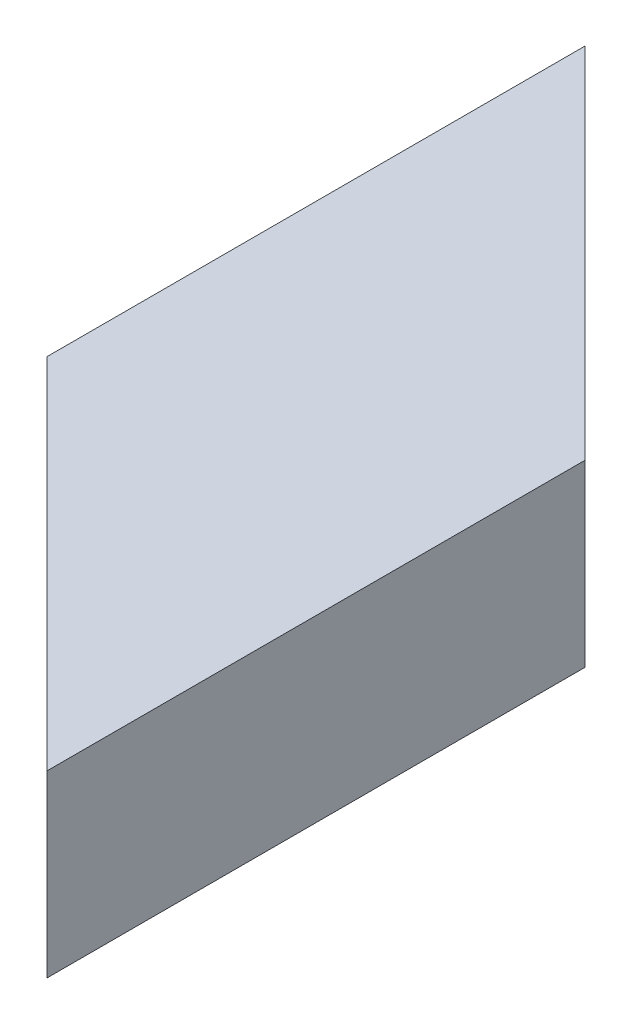
ISO-10303-21;
HEADER;
FILE_DESCRIPTION(('STEP AP214'),'2;1');
FILE_NAME('part.step','',(''),(''),'','','');
FILE_SCHEMA(('AUTOMOTIVE_DESIGN { 1 0 10303 214 1 1 1 1 }'));
ENDSEC;
DATA;
#1=APPLICATION_CONTEXT('core data for automotive mechanical design processes');
#2=APPLICATION_PROTOCOL_DEFINITION('international standard','automotive_design',2000,#1);
#3=PRODUCT_CONTEXT('',#1,'mechanical');
#4=PRODUCT('Part','Part','',(#3));
#5=PRODUCT_RELATED_PRODUCT_CATEGORY('part','',(#4));
#6=PRODUCT_DEFINITION_FORMATION('','',#4);
#7=PRODUCT_DEFINITION_CONTEXT('part definition',#1,'design');
#8=PRODUCT_DEFINITION('design','',#6,#7);
#9=PRODUCT_DEFINITION_SHAPE('','',#8);
#10=(LENGTH_UNIT() NAMED_UNIT(*) SI_UNIT(.MILLI.,.METRE.));
#11=(NAMED_UNIT(*) PLANE_ANGLE_UNIT() SI_UNIT($,.RADIAN.));
#12=(NAMED_UNIT(*) SI_UNIT($,.STERADIAN.) SOLID_ANGLE_UNIT());
#13=UNCERTAINTY_MEASURE_WITH_UNIT(LENGTH_MEASURE(1.E-05),#10,'distance_accuracy_value','');
#14=(GEOMETRIC_REPRESENTATION_CONTEXT(3) GLOBAL_UNCERTAINTY_ASSIGNED_CONTEXT((#13)) GLOBAL_UNIT_ASSIGNED_CONTEXT((#10,
#11,#12)) REPRESENTATION_CONTEXT('',''));
#15=CARTESIAN_POINT('',(0.,0.,0.));
#16=DIRECTION('',(0.,0.,1.));
#17=DIRECTION('',(1.,0.,0.));
#18=AXIS2_PLACEMENT_3D('',#15,#16,#17);
#19=CARTESIAN_POINT('',(0.,0.,127.));
#20=DIRECTION('',(1.,0.,0.));
#21=DIRECTION('',(0.,0.,-1.));
#22=AXIS2_PLACEMENT_3D('',#19,#20,#21);
#23=PLANE('',#22);
#24=DIRECTION('',(0.,0.,-1.));
#25=VECTOR('',#24,1.);
#26=CARTESIAN_POINT('',(0.,0.,127.));
#27=LINE('',#26,#25);
#28=CARTESIAN_POINT('',(0.,0.,76.1999999999995));
#29=VERTEX_POINT('',#28);
#30=CARTESIAN_POINT('',(0.,0.,0.));
#31=VERTEX_POINT('',#30);
#32=EDGE_CURVE('E114',#29,#31,#27,.T.);
#33=ORIENTED_EDGE('',*,*,#32,.F.);
#34=DIRECTION('',(0.,1.,0.));
#35=VECTOR('',#34,1.);
#36=CARTESIAN_POINT('',(0.,-101.6,76.1999999999995));
#37=LINE('',#36,#35);
#38=CARTESIAN_POINT('',(0.,25.4,76.1999999999995));
#39=VERTEX_POINT('',#38);
#40=EDGE_CURVE('E100',#29,#39,#37,.T.);
#41=ORIENTED_EDGE('',*,*,#40,.T.);
#42=DIRECTION('',(0.,0.,-1.));
#43=VECTOR('',#42,1.);
#44=CARTESIAN_POINT('',(0.,25.4,127.));
#45=LINE('',#44,#43);
#46=CARTESIAN_POINT('',(0.,25.4,0.));
#47=VERTEX_POINT('',#46);
#48=EDGE_CURVE('E112',#39,#47,#45,.T.);
#49=ORIENTED_EDGE('',*,*,#48,.T.);
#50=DIRECTION('',(0.,-1.,0.));
#51=VECTOR('',#50,1.);
#52=CARTESIAN_POINT('',(0.,0.,0.));
#53=LINE('',#52,#51);
#54=EDGE_CURVE('E124',#47,#31,#53,.T.);
#55=ORIENTED_EDGE('',*,*,#54,.T.);
#56=EDGE_LOOP('',(#33,#41,#49,#55));
#57=FACE_BOUND('',#56,.T.);
#58=ADVANCED_FACE('F33',(#57),#23,.F.);
#59=CARTESIAN_POINT('',(0.,0.,127.));
#60=DIRECTION('',(0.,1.,0.));
#61=DIRECTION('',(0.,0.,1.));
#62=AXIS2_PLACEMENT_3D('',#59,#60,#61);
#63=PLANE('',#62);
#64=DIRECTION('',(0.,0.,-1.));
#65=VECTOR('',#64,1.);
#66=CARTESIAN_POINT('',(50.8,0.,127.));
#67=LINE('',#66,#65);
#68=CARTESIAN_POINT('',(50.8,0.,127.));
#69=VERTEX_POINT('',#68);
#70=CARTESIAN_POINT('',(50.8,0.,50.8000000000005));
#71=VERTEX_POINT('',#70);
#72=EDGE_CURVE('E122',#69,#71,#67,.T.);
#73=ORIENTED_EDGE('',*,*,#72,.F.);
#74=DIRECTION('',(-0.707106781186544,0.,-0.707106781186551));
#75=VECTOR('',#74,1.);
#76=CARTESIAN_POINT('',(25.4000000000003,0.,101.6));
#77=LINE('',#76,#75);
#78=EDGE_CURVE('E169',#69,#29,#77,.T.);
#79=ORIENTED_EDGE('',*,*,#78,.T.);
#80=ORIENTED_EDGE('',*,*,#32,.T.);
#81=DIRECTION('',(0.707106781186544,0.,0.707106781186551));
#82=VECTOR('',#81,1.);
#83=CARTESIAN_POINT('',(63.5,0.,63.5000000000007));
#84=LINE('',#83,#82);
#85=EDGE_CURVE('E148',#31,#71,#84,.T.);
#86=ORIENTED_EDGE('',*,*,#85,.T.);
#87=EDGE_LOOP('',(#73,#79,#80,#86));
#88=FACE_BOUND('',#87,.T.);
#89=ADVANCED_FACE('F165',(#88),#63,.F.);
#90=CARTESIAN_POINT('',(50.8,0.,127.));
#91=DIRECTION('',(-1.,0.,0.));
#92=DIRECTION('',(0.,0.,1.));
#93=AXIS2_PLACEMENT_3D('',#90,#91,#92);
#94=PLANE('',#93);
#95=ORIENTED_EDGE('',*,*,#72,.T.);
#96=DIRECTION('',(0.,1.,0.));
#97=VECTOR('',#96,1.);
#98=CARTESIAN_POINT('',(50.8,-101.6,50.8000000000005));
#99=LINE('',#98,#97);
#100=CARTESIAN_POINT('',(50.8,25.4,50.8000000000005));
#101=VERTEX_POINT('',#100);
#102=EDGE_CURVE('E162',#71,#101,#99,.T.);
#103=ORIENTED_EDGE('',*,*,#102,.T.);
#104=DIRECTION('',(0.,0.,-1.));
#105=VECTOR('',#104,1.);
#106=CARTESIAN_POINT('',(50.8,25.4,127.));
#107=LINE('',#106,#105);
#108=CARTESIAN_POINT('',(50.8,25.4,127.));
#109=VERTEX_POINT('',#108);
#110=EDGE_CURVE('E120',#109,#101,#107,.T.);
#111=ORIENTED_EDGE('',*,*,#110,.F.);
#112=DIRECTION('',(0.,1.,0.));
#113=VECTOR('',#112,1.);
#114=CARTESIAN_POINT('',(50.8,0.,127.));
#115=LINE('',#114,#113);
#116=EDGE_CURVE('E103',#69,#109,#115,.T.);
#117=ORIENTED_EDGE('',*,*,#116,.F.);
#118=EDGE_LOOP('',(#95,#103,#111,#117));
#119=FACE_BOUND('',#118,.T.);
#120=ADVANCED_FACE('F167',(#119),#94,.F.);
#121=CARTESIAN_POINT('',(0.,25.4,127.));
#122=DIRECTION('',(0.,-1.,0.));
#123=DIRECTION('',(0.,0.,-1.));
#124=AXIS2_PLACEMENT_3D('',#121,#122,#123);
#125=PLANE('',#124);
#126=ORIENTED_EDGE('',*,*,#48,.F.);
#127=DIRECTION('',(-0.707106781186544,0.,-0.707106781186551));
#128=VECTOR('',#127,1.);
#129=CARTESIAN_POINT('',(50.8,25.4,127.));
#130=LINE('',#129,#128);
#131=EDGE_CURVE('E97',#109,#39,#130,.T.);
#132=ORIENTED_EDGE('',*,*,#131,.F.);
#133=ORIENTED_EDGE('',*,*,#110,.T.);
#134=DIRECTION('',(0.707106781186544,0.,0.707106781186551));
#135=VECTOR('',#134,1.);
#136=CARTESIAN_POINT('',(0.,25.4,0.));
#137=LINE('',#136,#135);
#138=EDGE_CURVE('E119',#47,#101,#137,.T.);
#139=ORIENTED_EDGE('',*,*,#138,.F.);
#140=EDGE_LOOP('',(#126,#132,#133,#139));
#141=FACE_BOUND('',#140,.T.);
#142=ADVANCED_FACE('F118',(#141),#125,.F.);
#143=CARTESIAN_POINT('',(3.175,3.175,127.));
#144=DIRECTION('',(1.,0.,0.));
#145=DIRECTION('',(0.,0.,-1.));
#146=AXIS2_PLACEMENT_3D('',#143,#144,#145);
#147=PLANE('',#146);
#148=DIRECTION('',(0.,1.,0.));
#149=VECTOR('',#148,1.);
#150=CARTESIAN_POINT('',(3.175,3.175,79.3749999999995));
#151=LINE('',#150,#149);
#152=CARTESIAN_POINT('',(3.175,3.175,79.3749999999995));
#153=VERTEX_POINT('',#152);
#154=CARTESIAN_POINT('',(3.175,22.225,79.3749999999995));
#155=VERTEX_POINT('',#154);
#156=EDGE_CURVE('E46',#153,#155,#151,.T.);
#157=ORIENTED_EDGE('',*,*,#156,.F.);
#158=DIRECTION('',(0.,0.,-1.));
#159=VECTOR('',#158,1.);
#160=CARTESIAN_POINT('',(3.175,3.175,127.));
#161=LINE('',#160,#159);
#162=CARTESIAN_POINT('',(3.175,3.175,3.17500000000001));
#163=VERTEX_POINT('',#162);
#164=EDGE_CURVE('E147',#153,#163,#161,.T.);
#165=ORIENTED_EDGE('',*,*,#164,.T.);
#166=DIRECTION('',(0.,-1.,0.));
#167=VECTOR('',#166,1.);
#168=CARTESIAN_POINT('',(3.175,3.175,3.17500000000003));
#169=LINE('',#168,#167);
#170=CARTESIAN_POINT('',(3.175,22.225,3.17500000000001));
#171=VERTEX_POINT('',#170);
#172=EDGE_CURVE('E138',#171,#163,#169,.T.);
#173=ORIENTED_EDGE('',*,*,#172,.F.);
#174=DIRECTION('',(0.,0.,-1.));
#175=VECTOR('',#174,1.);
#176=CARTESIAN_POINT('',(3.175,22.225,127.));
#177=LINE('',#176,#175);
#178=EDGE_CURVE('E145',#155,#171,#177,.T.);
#179=ORIENTED_EDGE('',*,*,#178,.F.);
#180=EDGE_LOOP('',(#157,#165,#173,#179));
#181=FACE_BOUND('',#180,.T.);
#182=ADVANCED_FACE('F144',(#181),#147,.T.);
#183=CARTESIAN_POINT('',(3.175,3.175,127.));
#184=DIRECTION('',(0.,1.,0.));
#185=DIRECTION('',(0.,0.,1.));
#186=AXIS2_PLACEMENT_3D('',#183,#184,#185);
#187=PLANE('',#186);
#188=DIRECTION('',(-0.707106781186544,0.,-0.707106781186551));
#189=VECTOR('',#188,1.);
#190=CARTESIAN_POINT('',(26.9875000000002,3.175,103.1875));
#191=LINE('',#190,#189);
#192=CARTESIAN_POINT('',(47.625,3.175,123.825));
#193=VERTEX_POINT('',#192);
#194=EDGE_CURVE('E174',#193,#153,#191,.T.);
#195=ORIENTED_EDGE('',*,*,#194,.F.);
#196=DIRECTION('',(0.,0.,-1.));
#197=VECTOR('',#196,1.);
#198=CARTESIAN_POINT('',(47.625,3.175,127.));
#199=LINE('',#198,#197);
#200=CARTESIAN_POINT('',(47.625,3.175,47.6250000000005));
#201=VERTEX_POINT('',#200);
#202=EDGE_CURVE('E158',#193,#201,#199,.T.);
#203=ORIENTED_EDGE('',*,*,#202,.T.);
#204=DIRECTION('',(0.707106781186544,0.,0.707106781186551));
#205=VECTOR('',#204,1.);
#206=CARTESIAN_POINT('',(65.0875,3.175,65.0875000000006));
#207=LINE('',#206,#205);
#208=EDGE_CURVE('E149',#163,#201,#207,.T.);
#209=ORIENTED_EDGE('',*,*,#208,.F.);
#210=ORIENTED_EDGE('',*,*,#164,.F.);
#211=EDGE_LOOP('',(#195,#203,#209,#210));
#212=FACE_BOUND('',#211,.T.);
#213=ADVANCED_FACE('F179',(#212),#187,.T.);
#214=CARTESIAN_POINT('',(47.625,3.175,127.));
#215=DIRECTION('',(-1.,0.,0.));
#216=DIRECTION('',(0.,0.,1.));
#217=AXIS2_PLACEMENT_3D('',#214,#215,#216);
#218=PLANE('',#217);
#219=DIRECTION('',(0.,-1.,0.));
#220=VECTOR('',#219,1.);
#221=CARTESIAN_POINT('',(47.625,3.175,123.825));
#222=LINE('',#221,#220);
#223=CARTESIAN_POINT('',(47.625,22.225,123.825));
#224=VERTEX_POINT('',#223);
#225=EDGE_CURVE('E115',#224,#193,#222,.T.);
#226=ORIENTED_EDGE('',*,*,#225,.F.);
#227=DIRECTION('',(0.,0.,-1.));
#228=VECTOR('',#227,1.);
#229=CARTESIAN_POINT('',(47.625,22.225,127.));
#230=LINE('',#229,#228);
#231=CARTESIAN_POINT('',(47.625,22.225,47.6250000000005));
#232=VERTEX_POINT('',#231);
#233=EDGE_CURVE('E54',#224,#232,#230,.T.);
#234=ORIENTED_EDGE('',*,*,#233,.T.);
#235=DIRECTION('',(0.,1.,0.));
#236=VECTOR('',#235,1.);
#237=CARTESIAN_POINT('',(47.625,3.175,47.6250000000005));
#238=LINE('',#237,#236);
#239=EDGE_CURVE('E140',#201,#232,#238,.T.);
#240=ORIENTED_EDGE('',*,*,#239,.F.);
#241=ORIENTED_EDGE('',*,*,#202,.F.);
#242=EDGE_LOOP('',(#226,#234,#240,#241));
#243=FACE_BOUND('',#242,.T.);
#244=ADVANCED_FACE('F180',(#243),#218,.T.);
#245=CARTESIAN_POINT('',(3.175,22.225,127.));
#246=DIRECTION('',(0.,-1.,0.));
#247=DIRECTION('',(0.,0.,-1.));
#248=AXIS2_PLACEMENT_3D('',#245,#246,#247);
#249=PLANE('',#248);
#250=DIRECTION('',(0.707106781186544,0.,0.707106781186551));
#251=VECTOR('',#250,1.);
#252=CARTESIAN_POINT('',(26.9875000000002,22.225,103.1875));
#253=LINE('',#252,#251);
#254=EDGE_CURVE('E11',#155,#224,#253,.T.);
#255=ORIENTED_EDGE('',*,*,#254,.F.);
#256=ORIENTED_EDGE('',*,*,#178,.T.);
#257=DIRECTION('',(-0.707106781186544,0.,-0.707106781186551));
#258=VECTOR('',#257,1.);
#259=CARTESIAN_POINT('',(65.0875,22.225,65.0875000000006));
#260=LINE('',#259,#258);
#261=EDGE_CURVE('E40',#232,#171,#260,.T.);
#262=ORIENTED_EDGE('',*,*,#261,.F.);
#263=ORIENTED_EDGE('',*,*,#233,.F.);
#264=EDGE_LOOP('',(#255,#256,#262,#263));
#265=FACE_BOUND('',#264,.T.);
#266=ADVANCED_FACE('F182',(#265),#249,.T.);
#267=CARTESIAN_POINT('',(0.,-101.6,0.));
#268=DIRECTION('',(-0.707106781186551,0.,0.707106781186544));
#269=DIRECTION('',(0.707106781186544,0.,0.707106781186551));
#270=AXIS2_PLACEMENT_3D('',#267,#268,#269);
#271=PLANE('',#270);
#272=ORIENTED_EDGE('',*,*,#172,.T.);
#273=ORIENTED_EDGE('',*,*,#208,.T.);
#274=ORIENTED_EDGE('',*,*,#239,.T.);
#275=ORIENTED_EDGE('',*,*,#261,.T.);
#276=EDGE_LOOP('',(#272,#273,#274,#275));
#277=FACE_BOUND('',#276,.T.);
#278=ORIENTED_EDGE('',*,*,#54,.F.);
#279=ORIENTED_EDGE('',*,*,#138,.T.);
#280=ORIENTED_EDGE('',*,*,#102,.F.);
#281=ORIENTED_EDGE('',*,*,#85,.F.);
#282=EDGE_LOOP('',(#278,#279,#280,#281));
#283=FACE_BOUND('',#282,.T.);
#284=ADVANCED_FACE('F135',(#277,#283),#271,.F.);
#285=CARTESIAN_POINT('',(50.8,-101.6,127.));
#286=DIRECTION('',(0.707106781186551,0.,-0.707106781186544));
#287=DIRECTION('',(-0.707106781186544,0.,-0.707106781186551));
#288=AXIS2_PLACEMENT_3D('',#285,#286,#287);
#289=PLANE('',#288);
#290=ORIENTED_EDGE('',*,*,#156,.T.);
#291=ORIENTED_EDGE('',*,*,#254,.T.);
#292=ORIENTED_EDGE('',*,*,#225,.T.);
#293=ORIENTED_EDGE('',*,*,#194,.T.);
#294=EDGE_LOOP('',(#290,#291,#292,#293));
#295=FACE_BOUND('',#294,.T.);
#296=ORIENTED_EDGE('',*,*,#116,.T.);
#297=ORIENTED_EDGE('',*,*,#131,.T.);
#298=ORIENTED_EDGE('',*,*,#40,.F.);
#299=ORIENTED_EDGE('',*,*,#78,.F.);
#300=EDGE_LOOP('',(#296,#297,#298,#299));
#301=FACE_BOUND('',#300,.T.);
#302=ADVANCED_FACE('F99',(#295,#301),#289,.F.);
#303=CLOSED_SHELL('',(#58,#89,#120,#142,#182,#213,#244,#266,#284,#302));
#304=MANIFOLD_SOLID_BREP('B2',#303);
#305=ADVANCED_BREP_SHAPE_REPRESENTATION('',(#18,#304),#14);
#306=SHAPE_DEFINITION_REPRESENTATION(#9,#305);
ENDSEC;
END-ISO-10303-21;
